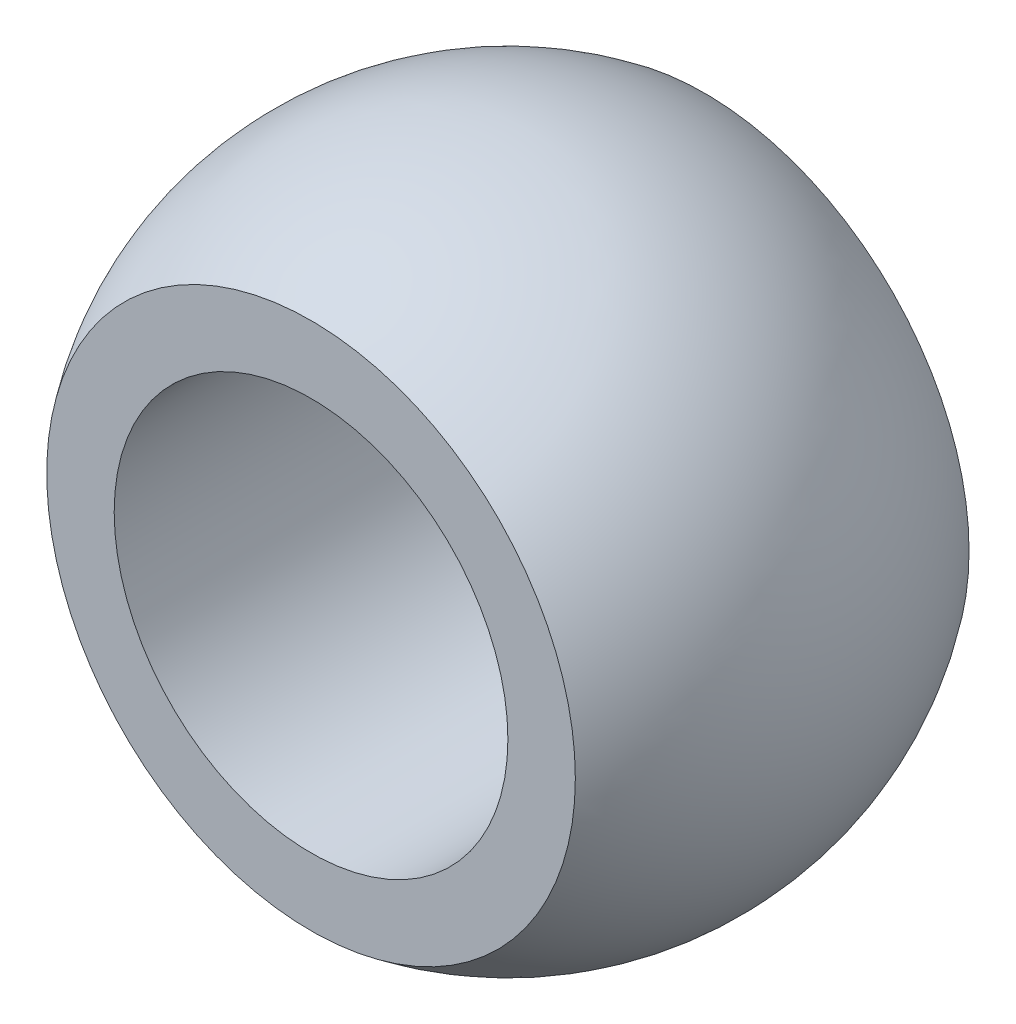
ISO-10303-21;
HEADER;
FILE_DESCRIPTION(('STEP AP214'),'2;1');
FILE_NAME('part.step','',(''),(''),'','','');
FILE_SCHEMA(('AUTOMOTIVE_DESIGN { 1 0 10303 214 1 1 1 1 }'));
ENDSEC;
DATA;
#1=APPLICATION_CONTEXT('core data for automotive mechanical design processes');
#2=APPLICATION_PROTOCOL_DEFINITION('international standard','automotive_design',2000,#1);
#3=PRODUCT_CONTEXT('',#1,'mechanical');
#4=PRODUCT('Part','Part','',(#3));
#5=PRODUCT_RELATED_PRODUCT_CATEGORY('part','',(#4));
#6=PRODUCT_DEFINITION_FORMATION('','',#4);
#7=PRODUCT_DEFINITION_CONTEXT('part definition',#1,'design');
#8=PRODUCT_DEFINITION('design','',#6,#7);
#9=PRODUCT_DEFINITION_SHAPE('','',#8);
#10=(LENGTH_UNIT() NAMED_UNIT(*) SI_UNIT(.MILLI.,.METRE.));
#11=(NAMED_UNIT(*) PLANE_ANGLE_UNIT() SI_UNIT($,.RADIAN.));
#12=(NAMED_UNIT(*) SI_UNIT($,.STERADIAN.) SOLID_ANGLE_UNIT());
#13=UNCERTAINTY_MEASURE_WITH_UNIT(LENGTH_MEASURE(1.E-05),#10,'distance_accuracy_value','');
#14=(GEOMETRIC_REPRESENTATION_CONTEXT(3) GLOBAL_UNCERTAINTY_ASSIGNED_CONTEXT((#13)) GLOBAL_UNIT_ASSIGNED_CONTEXT((#10,
#11,#12)) REPRESENTATION_CONTEXT('',''));
#15=CARTESIAN_POINT('',(0.,0.,0.));
#16=DIRECTION('',(0.,0.,1.));
#17=DIRECTION('',(1.,0.,0.));
#18=AXIS2_PLACEMENT_3D('',#15,#16,#17);
#19=CARTESIAN_POINT('',(0.,0.,0.));
#20=DIRECTION('',(0.,1.,0.));
#21=DIRECTION('',(-1.,0.,0.));
#22=AXIS2_PLACEMENT_3D('',#19,#20,#21);
#23=SPHERICAL_SURFACE('',#22,2.38125);
#24=CARTESIAN_POINT('',(0.,0.,0.));
#25=DIRECTION('',(0.,0.,1.));
#26=DIRECTION('',(1.,0.,0.));
#27=AXIS2_PLACEMENT_3D('',#24,#25,#26);
#28=SPHERICAL_SURFACE('',#27,2.38125);
#29=CARTESIAN_POINT('',(0.,0.,-1.4224));
#30=DIRECTION('',(0.,0.,1.));
#31=DIRECTION('',(1.,0.,0.));
#32=AXIS2_PLACEMENT_3D('',#29,#30,#31);
#33=CIRCLE('',#32,1.90974600470848);
#34=CARTESIAN_POINT('',(1.90974600470848,0.,-1.4224));
#35=VERTEX_POINT('',#34);
#36=EDGE_CURVE('E11',#35,#35,#33,.T.);
#37=ORIENTED_EDGE('',*,*,#36,.T.);
#38=EDGE_LOOP('',(#37));
#39=FACE_BOUND('',#38,.T.);
#40=CARTESIAN_POINT('',(0.,0.,1.4224));
#41=DIRECTION('',(0.,0.,1.));
#42=DIRECTION('',(1.,0.,0.));
#43=AXIS2_PLACEMENT_3D('',#40,#41,#42);
#44=CIRCLE('',#43,1.90974600470848);
#45=CARTESIAN_POINT('',(1.90974600470848,0.,1.4224));
#46=VERTEX_POINT('',#45);
#47=EDGE_CURVE('E42',#46,#46,#44,.T.);
#48=ORIENTED_EDGE('',*,*,#47,.F.);
#49=EDGE_LOOP('',(#48));
#50=FACE_BOUND('',#49,.T.);
#51=ADVANCED_FACE('F32',(#39,#50),#28,.T.);
#52=CARTESIAN_POINT('',(0.,0.,2.38125));
#53=DIRECTION('',(0.,0.,-1.));
#54=DIRECTION('',(-1.,0.,0.));
#55=AXIS2_PLACEMENT_3D('',#52,#53,#54);
#56=CYLINDRICAL_SURFACE('',#55,1.4224);
#57=CARTESIAN_POINT('',(0.,0.,-1.4224));
#58=DIRECTION('',(0.,0.,1.));
#59=DIRECTION('',(1.,0.,0.));
#60=AXIS2_PLACEMENT_3D('',#57,#58,#59);
#61=CIRCLE('',#60,1.4224);
#62=CARTESIAN_POINT('',(1.4224,0.,-1.4224));
#63=VERTEX_POINT('',#62);
#64=EDGE_CURVE('E38',#63,#63,#61,.T.);
#65=ORIENTED_EDGE('',*,*,#64,.F.);
#66=EDGE_LOOP('',(#65));
#67=FACE_BOUND('',#66,.T.);
#68=CARTESIAN_POINT('',(0.,0.,1.4224));
#69=DIRECTION('',(0.,0.,1.));
#70=DIRECTION('',(1.,0.,0.));
#71=AXIS2_PLACEMENT_3D('',#68,#69,#70);
#72=CIRCLE('',#71,1.4224);
#73=CARTESIAN_POINT('',(1.4224,0.,1.4224));
#74=VERTEX_POINT('',#73);
#75=EDGE_CURVE('E46',#74,#74,#72,.T.);
#76=ORIENTED_EDGE('',*,*,#75,.T.);
#77=EDGE_LOOP('',(#76));
#78=FACE_BOUND('',#77,.T.);
#79=ADVANCED_FACE('F52',(#67,#78),#56,.F.);
#80=CARTESIAN_POINT('',(0.,0.,-1.4224));
#81=DIRECTION('',(0.,0.,1.));
#82=DIRECTION('',(1.,0.,0.));
#83=AXIS2_PLACEMENT_3D('',#80,#81,#82);
#84=PLANE('',#83);
#85=ORIENTED_EDGE('',*,*,#64,.T.);
#86=EDGE_LOOP('',(#85));
#87=FACE_BOUND('',#86,.T.);
#88=ORIENTED_EDGE('',*,*,#36,.F.);
#89=EDGE_LOOP('',(#88));
#90=FACE_BOUND('',#89,.T.);
#91=ADVANCED_FACE('F57',(#87,#90),#84,.F.);
#92=CARTESIAN_POINT('',(0.,0.,1.4224));
#93=DIRECTION('',(0.,0.,1.));
#94=DIRECTION('',(1.,0.,0.));
#95=AXIS2_PLACEMENT_3D('',#92,#93,#94);
#96=PLANE('',#95);
#97=ORIENTED_EDGE('',*,*,#75,.F.);
#98=EDGE_LOOP('',(#97));
#99=FACE_BOUND('',#98,.T.);
#100=ORIENTED_EDGE('',*,*,#47,.T.);
#101=EDGE_LOOP('',(#100));
#102=FACE_BOUND('',#101,.T.);
#103=ADVANCED_FACE('F54',(#99,#102),#96,.T.);
#104=CLOSED_SHELL('',(#51,#79,#91,#103));
#105=MANIFOLD_SOLID_BREP('B2',#104);
#106=ADVANCED_BREP_SHAPE_REPRESENTATION('',(#18,#105),#14);
#107=SHAPE_DEFINITION_REPRESENTATION(#9,#106);
ENDSEC;
END-ISO-10303-21;
